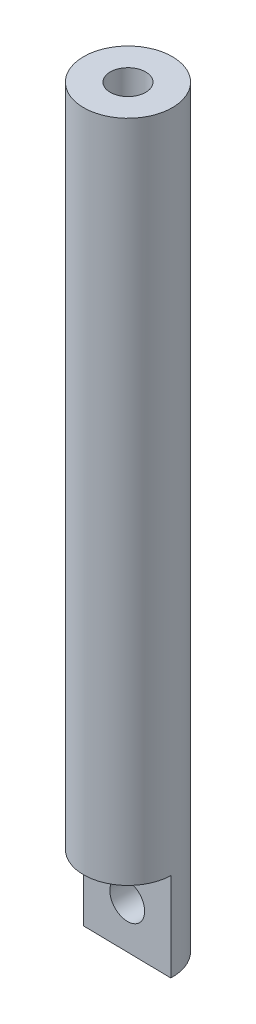
ISO-10303-21;
HEADER;
FILE_DESCRIPTION(('STEP AP214'),'2;1');
FILE_NAME('part.step','',(''),(''),'','','');
FILE_SCHEMA(('AUTOMOTIVE_DESIGN { 1 0 10303 214 1 1 1 1 }'));
ENDSEC;
DATA;
#1=APPLICATION_CONTEXT('core data for automotive mechanical design processes');
#2=APPLICATION_PROTOCOL_DEFINITION('international standard','automotive_design',2000,#1);
#3=PRODUCT_CONTEXT('',#1,'mechanical');
#4=PRODUCT('Part','Part','',(#3));
#5=PRODUCT_RELATED_PRODUCT_CATEGORY('part','',(#4));
#6=PRODUCT_DEFINITION_FORMATION('','',#4);
#7=PRODUCT_DEFINITION_CONTEXT('part definition',#1,'design');
#8=PRODUCT_DEFINITION('design','',#6,#7);
#9=PRODUCT_DEFINITION_SHAPE('','',#8);
#10=(LENGTH_UNIT() NAMED_UNIT(*) SI_UNIT(.MILLI.,.METRE.));
#11=(NAMED_UNIT(*) PLANE_ANGLE_UNIT() SI_UNIT($,.RADIAN.));
#12=(NAMED_UNIT(*) SI_UNIT($,.STERADIAN.) SOLID_ANGLE_UNIT());
#13=UNCERTAINTY_MEASURE_WITH_UNIT(LENGTH_MEASURE(1.E-05),#10,'distance_accuracy_value','');
#14=(GEOMETRIC_REPRESENTATION_CONTEXT(3) GLOBAL_UNCERTAINTY_ASSIGNED_CONTEXT((#13)) GLOBAL_UNIT_ASSIGNED_CONTEXT((#10,
#11,#12)) REPRESENTATION_CONTEXT('',''));
#15=CARTESIAN_POINT('',(0.,0.,0.));
#16=DIRECTION('',(0.,0.,1.));
#17=DIRECTION('',(1.,0.,0.));
#18=AXIS2_PLACEMENT_3D('',#15,#16,#17);
#19=CARTESIAN_POINT('',(0.,85.,0.));
#20=DIRECTION('',(0.,-1.,0.));
#21=DIRECTION('',(0.,0.,-1.));
#22=AXIS2_PLACEMENT_3D('',#19,#20,#21);
#23=CYLINDRICAL_SURFACE('',#22,5.);
#24=CARTESIAN_POINT('',(0.,6.9982645813904,-5.));
#25=CARTESIAN_POINT('',(-0.108162331572528,6.99374525340737,-4.99999182761106));
#26=CARTESIAN_POINT('',(-0.216120260066692,6.9804139102742,-4.99644977152268));
#27=CARTESIAN_POINT('',(-0.428245937869038,6.9366059913405,-4.98276826116594));
#28=CARTESIAN_POINT('',(-0.532402949096381,6.90608432499911,-4.97261144526023));
#29=CARTESIAN_POINT('',(-0.733547341075622,6.82917322916412,-4.946933403242));
#30=CARTESIAN_POINT('',(-0.830558004238616,6.78283837595941,-4.93143062583282));
#31=CARTESIAN_POINT('',(-1.01545340018059,6.67576725396687,-4.89670459340571));
#32=CARTESIAN_POINT('',(-1.10334090121181,6.61503537216199,-4.87748247205297));
#33=CARTESIAN_POINT('',(-1.271959980433,6.47764410397462,-4.83632012975041));
#34=CARTESIAN_POINT('',(-1.35218211274747,6.40038444256069,-4.81429590862933));
#35=CARTESIAN_POINT('',(-1.49887130092261,6.23359535188621,-4.77066598191732));
#36=CARTESIAN_POINT('',(-1.56533249144486,6.14406071756729,-4.74906045832989));
#37=CARTESIAN_POINT('',(-1.68474805717109,5.95143972125762,-4.70805229998965));
#38=CARTESIAN_POINT('',(-1.73716045883128,5.84799366709824,-4.68875074476598));
#39=CARTESIAN_POINT('',(-1.82346427631614,5.63280352558271,-4.65587078287476));
#40=CARTESIAN_POINT('',(-1.85736680777177,5.52106446428351,-4.64228894250132));
#41=CARTESIAN_POINT('',(-1.90379706799026,5.29916034265227,-4.62343540370952));
#42=CARTESIAN_POINT('',(-1.91742260294148,5.18926201523322,-4.61773817412706));
#43=CARTESIAN_POINT('',(-1.92619405255611,4.9686203883924,-4.61408780994642));
#44=CARTESIAN_POINT('',(-1.9213467710156,4.85787741506093,-4.61613182413843));
#45=CARTESIAN_POINT('',(-1.89429796644306,4.6459113629376,-4.62729061528255));
#46=CARTESIAN_POINT('',(-1.87318542419281,4.544522440108,-4.63596143824121));
#47=CARTESIAN_POINT('',(-1.81576273508442,4.3467974774672,-4.65875004148064));
#48=CARTESIAN_POINT('',(-1.77944940811241,4.25046249972633,-4.67286896149428));
#49=CARTESIAN_POINT('',(-1.69132337138553,4.06185345954423,-4.7054964660702));
#50=CARTESIAN_POINT('',(-1.63902208643802,3.96983175192484,-4.72413891820669));
#51=CARTESIAN_POINT('',(-1.52087067527033,3.79542198854749,-4.76348869516383));
#52=CARTESIAN_POINT('',(-1.45501514800163,3.71303779370092,-4.78419684141487));
#53=CARTESIAN_POINT('',(-1.30578603788681,3.5537396355045,-4.82715098967022));
#54=CARTESIAN_POINT('',(-1.22146443454146,3.47771018023994,-4.84939488988184));
#55=CARTESIAN_POINT('',(-1.04082992506951,3.34062816754012,-4.89134554546429));
#56=CARTESIAN_POINT('',(-0.944515873357859,3.27957704257506,-4.9110520580835));
#57=CARTESIAN_POINT('',(-0.741602443161874,3.17399602654687,-4.94577325547437));
#58=CARTESIAN_POINT('',(-0.634941920161664,3.1295729658318,-4.96075750716262));
#59=CARTESIAN_POINT('',(-0.414926296150532,3.05954720962253,-4.98397862621131));
#60=CARTESIAN_POINT('',(-0.301574831427949,3.03393439133815,-4.99221912301768));
#61=CARTESIAN_POINT('',(-0.0792022354238411,3.00366415160842,-5.00053131618442));
#62=CARTESIAN_POINT('',(0.0296335892009205,2.99777369694631,-5.00109077410365));
#63=CARTESIAN_POINT('',(0.246608321118626,3.00373002070283,-4.99509301821518));
#64=CARTESIAN_POINT('',(0.354747354289536,3.01557349975067,-4.98853712826933));
#65=CARTESIAN_POINT('',(0.563277392157171,3.05574925814064,-4.96923590388843));
#66=CARTESIAN_POINT('',(0.663807176658017,3.0834791210045,-4.95671937797839));
#67=CARTESIAN_POINT('',(0.858655083710228,3.15395078964821,-4.92670658014754));
#68=CARTESIAN_POINT('',(0.952972182848272,3.19669506143846,-4.90920949029392));
#69=CARTESIAN_POINT('',(1.13690714181537,3.29788670759065,-4.86997342362374));
#70=CARTESIAN_POINT('',(1.22618610761089,3.35689383237728,-4.84809276270278));
#71=CARTESIAN_POINT('',(1.39390015061422,3.48817545958118,-4.8025625523819));
#72=CARTESIAN_POINT('',(1.47233052132781,3.5604556888744,-4.77891224206071));
#73=CARTESIAN_POINT('',(1.62134701530734,3.72166730872611,-4.73051378086364));
#74=CARTESIAN_POINT('',(1.69111349124928,3.81136680532834,-4.70579184828525));
#75=CARTESIAN_POINT('',(1.81474734282589,4.00188929833059,-4.65951326231562));
#76=CARTESIAN_POINT('',(1.8686143681768,4.10271253973267,-4.63795667866603));
#77=CARTESIAN_POINT('',(1.95853471005568,4.31259714297042,-4.60070825991348));
#78=CARTESIAN_POINT('',(1.99465618405,4.42162510020978,-4.58499404283923));
#79=CARTESIAN_POINT('',(2.04786609506403,4.64502580169684,-4.56148143076939));
#80=CARTESIAN_POINT('',(2.06496858566218,4.75939453431536,-4.5536771912818));
#81=CARTESIAN_POINT('',(2.07879421629867,4.98085264611315,-4.54737942592312));
#82=CARTESIAN_POINT('',(2.07696734815265,5.08783469352067,-4.54822338816415));
#83=CARTESIAN_POINT('',(2.05647613252464,5.29982627358263,-4.55752452138106));
#84=CARTESIAN_POINT('',(2.03781221505615,5.40483585654334,-4.56598149792269));
#85=CARTESIAN_POINT('',(1.98511719345491,5.60722745029593,-4.58912856982142));
#86=CARTESIAN_POINT('',(1.95149525667045,5.70473639043102,-4.60365211094224));
#87=CARTESIAN_POINT('',(1.87011901382201,5.89280616537649,-4.63730370351265));
#88=CARTESIAN_POINT('',(1.82236055878139,5.98336495052158,-4.65643310644494));
#89=CARTESIAN_POINT('',(1.71037465576821,6.16140473285723,-4.69876840430127));
#90=CARTESIAN_POINT('',(1.64526887339562,6.24828898401757,-4.72215993095216));
#91=CARTESIAN_POINT('',(1.50195186370389,6.41027381512922,-4.76967875436765));
#92=CARTESIAN_POINT('',(1.42373613764201,6.4853703328719,-4.7938063013685));
#93=CARTESIAN_POINT('',(1.25109985799174,6.62592413294341,-4.84181902108471));
#94=CARTESIAN_POINT('',(1.1560143572209,6.69059938362055,-4.86561385699112));
#95=CARTESIAN_POINT('',(0.955314374640674,6.80290032284561,-4.90895984135903));
#96=CARTESIAN_POINT('',(0.849699600833863,6.8505255383943,-4.92851087208367));
#97=CARTESIAN_POINT('',(0.641329567246783,6.92328037820665,-4.95971131161743));
#98=CARTESIAN_POINT('',(0.539252650463972,6.95011477931791,-4.97193415199508));
#99=CARTESIAN_POINT('',(0.331769850437299,6.98727818563129,-4.99005963201687));
#100=CARTESIAN_POINT('',(0.226373756282196,6.99765179891581,-4.99597933851375));
#101=CARTESIAN_POINT('',(0.0805934243303094,7.00040857710909,-4.99951593182896));
#102=CARTESIAN_POINT('',(0.040282536645867,6.99994769964835,-5.00000304361557));
#103=CARTESIAN_POINT('',(0.,6.9982645813904,-5.));
#104=B_SPLINE_CURVE_WITH_KNOTS('',3,(#24,#25,#26,#27,#28,#29,#30,#31,#32,#33,#34,#35,#36,#37,
#38,#39,#40,#41,#42,#43,#44,#45,#46,#47,#48,#49,#50,#51,#52,#53,#54,#55,#56,#57,#58,#59,#60,#61,
#62,#63,#64,#65,#66,#67,#68,#69,#70,#71,#72,#73,#74,#75,#76,#77,#78,#79,#80,#81,#82,#83,#84,#85,
#86,#87,#88,#89,#90,#91,#92,#93,#94,#95,#96,#97,#98,#99,#100,#101,#102,#103),.UNSPECIFIED.,.T.,
.F.,(4,2,2,2,2,2,2,2,2,2,2,2,2,2,2,2,2,2,2,2,2,2,2,2,2,2,2,2,2,2,2,2,2,2,2,2,2,2,2,4),(0.,
0.3246505187956,0.650156594670438,0.974550420847556,1.29884552630294,1.63793673918993,
1.97717218704256,2.32805277700888,2.67872242215942,3.00961210318178,3.34037992469789,
3.65074359064079,3.96117221937872,4.28224064284278,4.60343725312475,4.94891817708639,
5.29443212865322,5.64212928126436,5.98963918218936,6.31497138232854,6.64024306243776,
6.95392746576587,7.26766341364582,7.59394923764453,7.92037617465224,8.2676280205394,
8.61488751622576,8.96080261515474,9.30646193901083,9.62585222042715,9.94523434493641,
10.2563711207198,10.5675993038305,10.8993506922585,11.2312161567828,11.581789665541,
11.9323728990974,12.2497155173875,12.5661966719976,12.6871051826626),.UNSPECIFIED.);
#105=CARTESIAN_POINT('',(0.,6.9982645813904,-5.));
#106=VERTEX_POINT('',#105);
#107=EDGE_CURVE('E72',#106,#106,#104,.T.);
#108=ORIENTED_EDGE('',*,*,#107,.T.);
#109=EDGE_LOOP('',(#108));
#110=FACE_BOUND('',#109,.T.);
#111=CARTESIAN_POINT('',(0.,85.,0.));
#112=DIRECTION('',(0.,1.,0.));
#113=DIRECTION('',(0.,0.,1.));
#114=AXIS2_PLACEMENT_3D('',#111,#112,#113);
#115=CIRCLE('',#114,5.);
#116=CARTESIAN_POINT('',(0.,85.,5.));
#117=VERTEX_POINT('',#116);
#118=EDGE_CURVE('E47',#117,#117,#115,.T.);
#119=ORIENTED_EDGE('',*,*,#118,.F.);
#120=EDGE_LOOP('',(#119));
#121=FACE_BOUND('',#120,.T.);
#122=CARTESIAN_POINT('',(0.,9.99999999999999,0.));
#123=DIRECTION('',(0.,1.,0.));
#124=DIRECTION('',(0.,0.,1.));
#125=AXIS2_PLACEMENT_3D('',#122,#123,#124);
#126=CIRCLE('',#125,5.);
#127=CARTESIAN_POINT('',(-5.,10.,0.));
#128=VERTEX_POINT('',#127);
#129=CARTESIAN_POINT('',(4.99722453489576,10.,0.166574151163516));
#130=VERTEX_POINT('',#129);
#131=EDGE_CURVE('E11',#128,#130,#126,.T.);
#132=ORIENTED_EDGE('',*,*,#131,.T.);
#133=DIRECTION('',(0.,-1.,0.));
#134=VECTOR('',#133,1.);
#135=CARTESIAN_POINT('',(4.99722453489576,10.,0.166574151163516));
#136=LINE('',#135,#134);
#137=CARTESIAN_POINT('',(4.99722453489576,0.,0.166574151163516));
#138=VERTEX_POINT('',#137);
#139=EDGE_CURVE('E60',#130,#138,#136,.T.);
#140=ORIENTED_EDGE('',*,*,#139,.T.);
#141=CARTESIAN_POINT('',(0.,0.,0.));
#142=DIRECTION('',(0.,1.,0.));
#143=DIRECTION('',(0.,0.,1.));
#144=AXIS2_PLACEMENT_3D('',#141,#142,#143);
#145=CIRCLE('',#144,5.);
#146=CARTESIAN_POINT('',(-5.,0.,0.));
#147=VERTEX_POINT('',#146);
#148=EDGE_CURVE('E75',#138,#147,#145,.T.);
#149=ORIENTED_EDGE('',*,*,#148,.T.);
#150=DIRECTION('',(0.,-1.,0.));
#151=VECTOR('',#150,1.);
#152=CARTESIAN_POINT('',(-5.,10.,0.));
#153=LINE('',#152,#151);
#154=EDGE_CURVE('E54',#128,#147,#153,.T.);
#155=ORIENTED_EDGE('',*,*,#154,.F.);
#156=EDGE_LOOP('',(#132,#140,#149,#155));
#157=FACE_BOUND('',#156,.T.);
#158=ADVANCED_FACE('F38',(#110,#121,#157),#23,.T.);
#159=CARTESIAN_POINT('',(0.,85.,0.));
#160=DIRECTION('',(0.,1.,0.));
#161=DIRECTION('',(0.,0.,1.));
#162=AXIS2_PLACEMENT_3D('',#159,#160,#161);
#163=PLANE('',#162);
#164=CARTESIAN_POINT('',(0.,85.,0.));
#165=DIRECTION('',(0.,1.,0.));
#166=DIRECTION('',(0.,0.,1.));
#167=AXIS2_PLACEMENT_3D('',#164,#165,#166);
#168=CIRCLE('',#167,2.);
#169=CARTESIAN_POINT('',(0.,85.,2.));
#170=VERTEX_POINT('',#169);
#171=EDGE_CURVE('E77',#170,#170,#168,.T.);
#172=ORIENTED_EDGE('',*,*,#171,.F.);
#173=EDGE_LOOP('',(#172));
#174=FACE_BOUND('',#173,.T.);
#175=ORIENTED_EDGE('',*,*,#118,.T.);
#176=EDGE_LOOP('',(#175));
#177=FACE_BOUND('',#176,.T.);
#178=ADVANCED_FACE('F124',(#174,#177),#163,.T.);
#179=CARTESIAN_POINT('',(0.,0.,0.));
#180=DIRECTION('',(0.,1.,0.));
#181=DIRECTION('',(0.,0.,1.));
#182=AXIS2_PLACEMENT_3D('',#179,#180,#181);
#183=PLANE('',#182);
#184=ORIENTED_EDGE('',*,*,#148,.F.);
#185=DIRECTION('',(0.999861217114443,0.,0.0166597272013652));
#186=VECTOR('',#185,1.);
#187=CARTESIAN_POINT('',(-5.,0.,0.));
#188=LINE('',#187,#186);
#189=EDGE_CURVE('E65',#147,#138,#188,.T.);
#190=ORIENTED_EDGE('',*,*,#189,.F.);
#191=EDGE_LOOP('',(#184,#190));
#192=FACE_BOUND('',#191,.T.);
#193=ADVANCED_FACE('F79',(#192),#183,.F.);
#194=CARTESIAN_POINT('',(0.,70.,0.));
#195=DIRECTION('',(0.,1.,0.));
#196=DIRECTION('',(0.,0.,1.));
#197=AXIS2_PLACEMENT_3D('',#194,#195,#196);
#198=CYLINDRICAL_SURFACE('',#197,2.);
#199=CARTESIAN_POINT('',(0.,70.,0.));
#200=DIRECTION('',(0.,1.,0.));
#201=DIRECTION('',(0.,0.,1.));
#202=AXIS2_PLACEMENT_3D('',#199,#200,#201);
#203=CIRCLE('',#202,2.);
#204=CARTESIAN_POINT('',(0.,70.,2.));
#205=VERTEX_POINT('',#204);
#206=EDGE_CURVE('E81',#205,#205,#203,.T.);
#207=ORIENTED_EDGE('',*,*,#206,.F.);
#208=EDGE_LOOP('',(#207));
#209=FACE_BOUND('',#208,.T.);
#210=ORIENTED_EDGE('',*,*,#171,.T.);
#211=EDGE_LOOP('',(#210));
#212=FACE_BOUND('',#211,.T.);
#213=ADVANCED_FACE('F119',(#209,#212),#198,.F.);
#214=CARTESIAN_POINT('',(0.,70.,0.));
#215=DIRECTION('',(0.,1.,0.));
#216=DIRECTION('',(0.,0.,1.));
#217=AXIS2_PLACEMENT_3D('',#214,#215,#216);
#218=PLANE('',#217);
#219=ORIENTED_EDGE('',*,*,#206,.T.);
#220=EDGE_LOOP('',(#219));
#221=FACE_BOUND('',#220,.T.);
#222=ADVANCED_FACE('F112',(#221),#218,.T.);
#223=CARTESIAN_POINT('',(-0.00138773255211992,10.,0.0832870755817578));
#224=DIRECTION('',(0.,1.,0.));
#225=DIRECTION('',(0.,0.,1.));
#226=AXIS2_PLACEMENT_3D('',#223,#224,#225);
#227=PLANE('',#226);
#228=DIRECTION('',(0.999861217114443,0.,0.0166597272013652));
#229=VECTOR('',#228,1.);
#230=CARTESIAN_POINT('',(-5.,10.,0.));
#231=LINE('',#230,#229);
#232=EDGE_CURVE('E71',#128,#130,#231,.T.);
#233=ORIENTED_EDGE('',*,*,#232,.T.);
#234=ORIENTED_EDGE('',*,*,#131,.F.);
#235=EDGE_LOOP('',(#233,#234));
#236=FACE_BOUND('',#235,.T.);
#237=ADVANCED_FACE('F109',(#236),#227,.F.);
#238=CARTESIAN_POINT('',(-5.,10.,0.));
#239=DIRECTION('',(0.0166597272013652,0.,-0.999861217114443));
#240=DIRECTION('',(-0.999861217114443,0.,-0.0166597272013652));
#241=AXIS2_PLACEMENT_3D('',#238,#239,#240);
#242=PLANE('',#241);
#243=CARTESIAN_POINT('',(-0.0013877325521204,5.,0.0832870755817578));
#244=DIRECTION('',(-0.0166597272013652,0.,0.999861217114443));
#245=DIRECTION('',(0.999861217114444,0.,0.0166597272013652));
#246=AXIS2_PLACEMENT_3D('',#243,#244,#245);
#247=CIRCLE('',#246,2.);
#248=CARTESIAN_POINT('',(1.99833470167677,5.,0.116606529984488));
#249=VERTEX_POINT('',#248);
#250=EDGE_CURVE('E103',#249,#249,#247,.T.);
#251=ORIENTED_EDGE('',*,*,#250,.F.);
#252=EDGE_LOOP('',(#251));
#253=FACE_BOUND('',#252,.T.);
#254=ORIENTED_EDGE('',*,*,#189,.T.);
#255=ORIENTED_EDGE('',*,*,#139,.F.);
#256=ORIENTED_EDGE('',*,*,#232,.F.);
#257=ORIENTED_EDGE('',*,*,#154,.T.);
#258=EDGE_LOOP('',(#254,#255,#256,#257));
#259=FACE_BOUND('',#258,.T.);
#260=ADVANCED_FACE('F66',(#253,#259),#242,.F.);
#261=CARTESIAN_POINT('',(0.0846748081338765,5.,-5.08189934302964));
#262=DIRECTION('',(-0.0166597272013652,0.,0.999861217114443));
#263=DIRECTION('',(0.999861217114444,0.,0.0166597272013652));
#264=AXIS2_PLACEMENT_3D('',#261,#262,#263);
#265=CYLINDRICAL_SURFACE('',#264,2.);
#266=ORIENTED_EDGE('',*,*,#250,.T.);
#267=EDGE_LOOP('',(#266));
#268=FACE_BOUND('',#267,.T.);
#269=ORIENTED_EDGE('',*,*,#107,.F.);
#270=EDGE_LOOP('',(#269));
#271=FACE_BOUND('',#270,.T.);
#272=ADVANCED_FACE('F104',(#268,#271),#265,.F.);
#273=CLOSED_SHELL('',(#158,#178,#193,#213,#222,#237,#260,#272));
#274=MANIFOLD_SOLID_BREP('B2',#273);
#275=ADVANCED_BREP_SHAPE_REPRESENTATION('',(#18,#274),#14);
#276=SHAPE_DEFINITION_REPRESENTATION(#9,#275);
ENDSEC;
END-ISO-10303-21;
